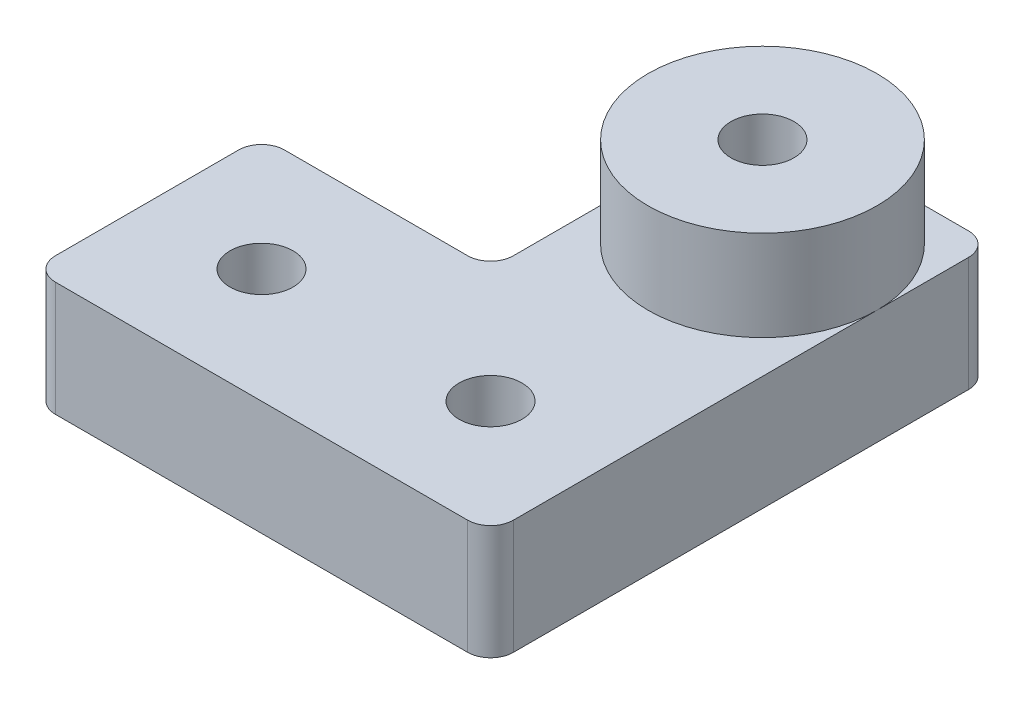
ISO-10303-21;
HEADER;
FILE_DESCRIPTION(('STEP AP214'),'2;1');
FILE_NAME('part.step','',(''),(''),'','','');
FILE_SCHEMA(('AUTOMOTIVE_DESIGN { 1 0 10303 214 1 1 1 1 }'));
ENDSEC;
DATA;
#1=APPLICATION_CONTEXT('core data for automotive mechanical design processes');
#2=APPLICATION_PROTOCOL_DEFINITION('international standard','automotive_design',2000,#1);
#3=PRODUCT_CONTEXT('',#1,'mechanical');
#4=PRODUCT('Part','Part','',(#3));
#5=PRODUCT_RELATED_PRODUCT_CATEGORY('part','',(#4));
#6=PRODUCT_DEFINITION_FORMATION('','',#4);
#7=PRODUCT_DEFINITION_CONTEXT('part definition',#1,'design');
#8=PRODUCT_DEFINITION('design','',#6,#7);
#9=PRODUCT_DEFINITION_SHAPE('','',#8);
#10=(LENGTH_UNIT() NAMED_UNIT(*) SI_UNIT(.MILLI.,.METRE.));
#11=(NAMED_UNIT(*) PLANE_ANGLE_UNIT() SI_UNIT($,.RADIAN.));
#12=(NAMED_UNIT(*) SI_UNIT($,.STERADIAN.) SOLID_ANGLE_UNIT());
#13=UNCERTAINTY_MEASURE_WITH_UNIT(LENGTH_MEASURE(1.E-05),#10,'distance_accuracy_value','');
#14=(GEOMETRIC_REPRESENTATION_CONTEXT(3) GLOBAL_UNCERTAINTY_ASSIGNED_CONTEXT((#13)) GLOBAL_UNIT_ASSIGNED_CONTEXT((#10,
#11,#12)) REPRESENTATION_CONTEXT('',''));
#15=CARTESIAN_POINT('',(0.,0.,0.));
#16=DIRECTION('',(0.,0.,1.));
#17=DIRECTION('',(1.,0.,0.));
#18=AXIS2_PLACEMENT_3D('',#15,#16,#17);
#19=CARTESIAN_POINT('',(0.,10.,0.));
#20=DIRECTION('',(0.,1.,0.));
#21=DIRECTION('',(0.,0.,1.));
#22=AXIS2_PLACEMENT_3D('',#19,#20,#21);
#23=PLANE('',#22);
#24=CARTESIAN_POINT('',(30.,10.,-33.75));
#25=DIRECTION('',(0.,1.,0.));
#26=DIRECTION('',(0.,0.,1.));
#27=AXIS2_PLACEMENT_3D('',#24,#25,#26);
#28=CIRCLE('',#27,10.);
#29=CARTESIAN_POINT('',(40.,10.,-33.75));
#30=VERTEX_POINT('',#29);
#31=CARTESIAN_POINT('',(30.,10.,-43.75));
#32=VERTEX_POINT('',#31);
#33=EDGE_CURVE('E54',#30,#32,#28,.T.);
#34=ORIENTED_EDGE('',*,*,#33,.F.);
#35=DIRECTION('',(0.,0.,-1.));
#36=VECTOR('',#35,1.);
#37=CARTESIAN_POINT('',(40.,10.,0.));
#38=LINE('',#37,#36);
#39=CARTESIAN_POINT('',(40.,10.,-41.75));
#40=VERTEX_POINT('',#39);
#41=EDGE_CURVE('E187',#30,#40,#38,.T.);
#42=ORIENTED_EDGE('',*,*,#41,.T.);
#43=CARTESIAN_POINT('',(38.,10.,-41.75));
#44=DIRECTION('',(0.,1.,0.));
#45=DIRECTION('',(0.,0.,1.));
#46=AXIS2_PLACEMENT_3D('',#43,#44,#45);
#47=CIRCLE('',#46,2.);
#48=CARTESIAN_POINT('',(38.,10.,-43.75));
#49=VERTEX_POINT('',#48);
#50=EDGE_CURVE('E349',#40,#49,#47,.T.);
#51=ORIENTED_EDGE('',*,*,#50,.T.);
#52=DIRECTION('',(-1.,0.,0.));
#53=VECTOR('',#52,1.);
#54=CARTESIAN_POINT('',(40.,10.,-43.75));
#55=LINE('',#54,#53);
#56=EDGE_CURVE('E201',#49,#32,#55,.T.);
#57=ORIENTED_EDGE('',*,*,#56,.T.);
#58=EDGE_LOOP('',(#34,#42,#51,#57));
#59=FACE_BOUND('',#58,.T.);
#60=ADVANCED_FACE('F43',(#59),#23,.T.);
#61=CARTESIAN_POINT('',(20.,10.,-33.75));
#62=VERTEX_POINT('',#61);
#63=EDGE_CURVE('E11',#32,#62,#28,.T.);
#64=ORIENTED_EDGE('',*,*,#63,.F.);
#65=CARTESIAN_POINT('',(22.,10.,-43.75));
#66=VERTEX_POINT('',#65);
#67=EDGE_CURVE('E186',#32,#66,#55,.T.);
#68=ORIENTED_EDGE('',*,*,#67,.T.);
#69=CARTESIAN_POINT('',(22.,10.,-41.75));
#70=DIRECTION('',(0.,1.,0.));
#71=DIRECTION('',(0.,0.,1.));
#72=AXIS2_PLACEMENT_3D('',#69,#70,#71);
#73=CIRCLE('',#72,2.);
#74=CARTESIAN_POINT('',(20.,10.,-41.75));
#75=VERTEX_POINT('',#74);
#76=EDGE_CURVE('E351',#66,#75,#73,.T.);
#77=ORIENTED_EDGE('',*,*,#76,.T.);
#78=DIRECTION('',(0.,0.,1.));
#79=VECTOR('',#78,1.);
#80=CARTESIAN_POINT('',(20.,10.,-43.75));
#81=LINE('',#80,#79);
#82=EDGE_CURVE('E297',#75,#62,#81,.T.);
#83=ORIENTED_EDGE('',*,*,#82,.T.);
#84=EDGE_LOOP('',(#64,#68,#77,#83));
#85=FACE_BOUND('',#84,.T.);
#86=ADVANCED_FACE('F411',(#85),#23,.T.);
#87=EDGE_CURVE('E52',#62,#30,#28,.T.);
#88=ORIENTED_EDGE('',*,*,#87,.F.);
#89=CARTESIAN_POINT('',(20.,10.,-22.));
#90=VERTEX_POINT('',#89);
#91=EDGE_CURVE('E296',#62,#90,#81,.T.);
#92=ORIENTED_EDGE('',*,*,#91,.T.);
#93=CARTESIAN_POINT('',(18.,10.,-22.));
#94=DIRECTION('',(0.,1.,0.));
#95=DIRECTION('',(0.,0.,1.));
#96=AXIS2_PLACEMENT_3D('',#93,#94,#95);
#97=CIRCLE('',#96,2.);
#98=CARTESIAN_POINT('',(18.,10.,-20.));
#99=VERTEX_POINT('',#98);
#100=EDGE_CURVE('E206',#90,#99,#97,.F.);
#101=ORIENTED_EDGE('',*,*,#100,.T.);
#102=DIRECTION('',(-1.,0.,0.));
#103=VECTOR('',#102,1.);
#104=CARTESIAN_POINT('',(20.,10.,-20.));
#105=LINE('',#104,#103);
#106=CARTESIAN_POINT('',(2.,10.,-20.));
#107=VERTEX_POINT('',#106);
#108=EDGE_CURVE('E299',#99,#107,#105,.T.);
#109=ORIENTED_EDGE('',*,*,#108,.T.);
#110=CARTESIAN_POINT('',(2.,10.,-18.));
#111=DIRECTION('',(0.,1.,0.));
#112=DIRECTION('',(0.,0.,1.));
#113=AXIS2_PLACEMENT_3D('',#110,#111,#112);
#114=CIRCLE('',#113,2.);
#115=CARTESIAN_POINT('',(0.,10.,-18.));
#116=VERTEX_POINT('',#115);
#117=EDGE_CURVE('E347',#107,#116,#114,.T.);
#118=ORIENTED_EDGE('',*,*,#117,.T.);
#119=DIRECTION('',(0.,0.,1.));
#120=VECTOR('',#119,1.);
#121=CARTESIAN_POINT('',(0.,10.,-20.));
#122=LINE('',#121,#120);
#123=CARTESIAN_POINT('',(0.,10.,-2.));
#124=VERTEX_POINT('',#123);
#125=EDGE_CURVE('E290',#116,#124,#122,.T.);
#126=ORIENTED_EDGE('',*,*,#125,.T.);
#127=CARTESIAN_POINT('',(2.,10.,-2.));
#128=DIRECTION('',(0.,1.,0.));
#129=DIRECTION('',(0.,0.,1.));
#130=AXIS2_PLACEMENT_3D('',#127,#128,#129);
#131=CIRCLE('',#130,2.);
#132=CARTESIAN_POINT('',(2.,10.,0.));
#133=VERTEX_POINT('',#132);
#134=EDGE_CURVE('E345',#124,#133,#131,.T.);
#135=ORIENTED_EDGE('',*,*,#134,.T.);
#136=DIRECTION('',(1.,0.,0.));
#137=VECTOR('',#136,1.);
#138=CARTESIAN_POINT('',(0.,10.,0.));
#139=LINE('',#138,#137);
#140=CARTESIAN_POINT('',(38.,10.,0.));
#141=VERTEX_POINT('',#140);
#142=EDGE_CURVE('E197',#133,#141,#139,.T.);
#143=ORIENTED_EDGE('',*,*,#142,.T.);
#144=CARTESIAN_POINT('',(38.,10.,-2.));
#145=DIRECTION('',(0.,1.,0.));
#146=DIRECTION('',(0.,0.,1.));
#147=AXIS2_PLACEMENT_3D('',#144,#145,#146);
#148=CIRCLE('',#147,2.);
#149=CARTESIAN_POINT('',(40.,10.,-2.));
#150=VERTEX_POINT('',#149);
#151=EDGE_CURVE('E182',#141,#150,#148,.T.);
#152=ORIENTED_EDGE('',*,*,#151,.T.);
#153=EDGE_CURVE('E176',#150,#30,#38,.T.);
#154=ORIENTED_EDGE('',*,*,#153,.T.);
#155=EDGE_LOOP('',(#88,#92,#101,#109,#118,#126,#135,#143,#152,#154));
#156=FACE_BOUND('',#155,.T.);
#157=CARTESIAN_POINT('',(30.,10.,-10.));
#158=DIRECTION('',(0.,-1.,0.));
#159=DIRECTION('',(0.,0.,-1.));
#160=AXIS2_PLACEMENT_3D('',#157,#158,#159);
#161=CIRCLE('',#160,2.75);
#162=CARTESIAN_POINT('',(30.,10.,-12.75));
#163=VERTEX_POINT('',#162);
#164=EDGE_CURVE('E286',#163,#163,#161,.T.);
#165=ORIENTED_EDGE('',*,*,#164,.T.);
#166=EDGE_LOOP('',(#165));
#167=FACE_BOUND('',#166,.T.);
#168=CARTESIAN_POINT('',(10.,10.,-10.));
#169=DIRECTION('',(0.,-1.,0.));
#170=DIRECTION('',(0.,0.,-1.));
#171=AXIS2_PLACEMENT_3D('',#168,#169,#170);
#172=CIRCLE('',#171,2.75);
#173=CARTESIAN_POINT('',(10.,10.,-12.75));
#174=VERTEX_POINT('',#173);
#175=EDGE_CURVE('E271',#174,#174,#172,.T.);
#176=ORIENTED_EDGE('',*,*,#175,.T.);
#177=EDGE_LOOP('',(#176));
#178=FACE_BOUND('',#177,.T.);
#179=ADVANCED_FACE('F178',(#156,#167,#178),#23,.T.);
#180=CARTESIAN_POINT('',(0.,10.,-20.));
#181=DIRECTION('',(1.,0.,0.));
#182=DIRECTION('',(0.,0.,-1.));
#183=AXIS2_PLACEMENT_3D('',#180,#181,#182);
#184=PLANE('',#183);
#185=ORIENTED_EDGE('',*,*,#125,.F.);
#186=DIRECTION('',(0.,-1.,0.));
#187=VECTOR('',#186,1.);
#188=CARTESIAN_POINT('',(0.,10.,-18.));
#189=LINE('',#188,#187);
#190=CARTESIAN_POINT('',(0.,0.,-18.));
#191=VERTEX_POINT('',#190);
#192=EDGE_CURVE('E358',#116,#191,#189,.T.);
#193=ORIENTED_EDGE('',*,*,#192,.T.);
#194=DIRECTION('',(0.,0.,1.));
#195=VECTOR('',#194,1.);
#196=CARTESIAN_POINT('',(0.,0.,-20.));
#197=LINE('',#196,#195);
#198=CARTESIAN_POINT('',(0.,0.,-2.));
#199=VERTEX_POINT('',#198);
#200=EDGE_CURVE('E289',#191,#199,#197,.T.);
#201=ORIENTED_EDGE('',*,*,#200,.T.);
#202=DIRECTION('',(0.,-1.,0.));
#203=VECTOR('',#202,1.);
#204=CARTESIAN_POINT('',(0.,10.,-2.));
#205=LINE('',#204,#203);
#206=EDGE_CURVE('E356',#199,#124,#205,.F.);
#207=ORIENTED_EDGE('',*,*,#206,.T.);
#208=EDGE_LOOP('',(#185,#193,#201,#207));
#209=FACE_BOUND('',#208,.T.);
#210=ADVANCED_FACE('F390',(#209),#184,.F.);
#211=CARTESIAN_POINT('',(0.,10.,0.));
#212=DIRECTION('',(0.,0.,-1.));
#213=DIRECTION('',(-1.,0.,0.));
#214=AXIS2_PLACEMENT_3D('',#211,#212,#213);
#215=PLANE('',#214);
#216=ORIENTED_EDGE('',*,*,#142,.F.);
#217=DIRECTION('',(0.,-1.,0.));
#218=VECTOR('',#217,1.);
#219=CARTESIAN_POINT('',(2.,10.,0.));
#220=LINE('',#219,#218);
#221=CARTESIAN_POINT('',(2.,0.,0.));
#222=VERTEX_POINT('',#221);
#223=EDGE_CURVE('E363',#133,#222,#220,.T.);
#224=ORIENTED_EDGE('',*,*,#223,.T.);
#225=DIRECTION('',(1.,0.,0.));
#226=VECTOR('',#225,1.);
#227=CARTESIAN_POINT('',(0.,0.,0.));
#228=LINE('',#227,#226);
#229=CARTESIAN_POINT('',(38.,0.,0.));
#230=VERTEX_POINT('',#229);
#231=EDGE_CURVE('E305',#222,#230,#228,.T.);
#232=ORIENTED_EDGE('',*,*,#231,.T.);
#233=DIRECTION('',(0.,-1.,0.));
#234=VECTOR('',#233,1.);
#235=CARTESIAN_POINT('',(38.,10.,0.));
#236=LINE('',#235,#234);
#237=EDGE_CURVE('E361',#230,#141,#236,.F.);
#238=ORIENTED_EDGE('',*,*,#237,.T.);
#239=EDGE_LOOP('',(#216,#224,#232,#238));
#240=FACE_BOUND('',#239,.T.);
#241=ADVANCED_FACE('F398',(#240),#215,.F.);
#242=CARTESIAN_POINT('',(40.,10.,0.));
#243=DIRECTION('',(-1.,0.,0.));
#244=DIRECTION('',(0.,0.,1.));
#245=AXIS2_PLACEMENT_3D('',#242,#243,#244);
#246=PLANE('',#245);
#247=DIRECTION('',(0.,0.,-1.));
#248=VECTOR('',#247,1.);
#249=CARTESIAN_POINT('',(40.,0.,0.));
#250=LINE('',#249,#248);
#251=CARTESIAN_POINT('',(40.,0.,-2.));
#252=VERTEX_POINT('',#251);
#253=CARTESIAN_POINT('',(40.,0.,-41.75));
#254=VERTEX_POINT('',#253);
#255=EDGE_CURVE('E308',#252,#254,#250,.T.);
#256=ORIENTED_EDGE('',*,*,#255,.T.);
#257=DIRECTION('',(0.,-1.,0.));
#258=VECTOR('',#257,1.);
#259=CARTESIAN_POINT('',(40.,10.,-41.75));
#260=LINE('',#259,#258);
#261=EDGE_CURVE('E194',#254,#40,#260,.F.);
#262=ORIENTED_EDGE('',*,*,#261,.T.);
#263=ORIENTED_EDGE('',*,*,#41,.F.);
#264=ORIENTED_EDGE('',*,*,#153,.F.);
#265=DIRECTION('',(0.,-1.,0.));
#266=VECTOR('',#265,1.);
#267=CARTESIAN_POINT('',(40.,10.,-2.));
#268=LINE('',#267,#266);
#269=EDGE_CURVE('E353',#150,#252,#268,.T.);
#270=ORIENTED_EDGE('',*,*,#269,.T.);
#271=EDGE_LOOP('',(#256,#262,#263,#264,#270));
#272=FACE_BOUND('',#271,.T.);
#273=ADVANCED_FACE('F192',(#272),#246,.F.);
#274=CARTESIAN_POINT('',(40.,10.,-43.75));
#275=DIRECTION('',(0.,0.,1.));
#276=DIRECTION('',(1.,0.,0.));
#277=AXIS2_PLACEMENT_3D('',#274,#275,#276);
#278=PLANE('',#277);
#279=DIRECTION('',(-1.,0.,0.));
#280=VECTOR('',#279,1.);
#281=CARTESIAN_POINT('',(40.,0.,-43.75));
#282=LINE('',#281,#280);
#283=CARTESIAN_POINT('',(38.,0.,-43.75));
#284=VERTEX_POINT('',#283);
#285=CARTESIAN_POINT('',(22.,0.,-43.75));
#286=VERTEX_POINT('',#285);
#287=EDGE_CURVE('E310',#284,#286,#282,.T.);
#288=ORIENTED_EDGE('',*,*,#287,.T.);
#289=DIRECTION('',(0.,-1.,0.));
#290=VECTOR('',#289,1.);
#291=CARTESIAN_POINT('',(22.,10.,-43.75));
#292=LINE('',#291,#290);
#293=EDGE_CURVE('E341',#286,#66,#292,.F.);
#294=ORIENTED_EDGE('',*,*,#293,.T.);
#295=ORIENTED_EDGE('',*,*,#67,.F.);
#296=ORIENTED_EDGE('',*,*,#56,.F.);
#297=DIRECTION('',(0.,-1.,0.));
#298=VECTOR('',#297,1.);
#299=CARTESIAN_POINT('',(38.,10.,-43.75));
#300=LINE('',#299,#298);
#301=EDGE_CURVE('E338',#49,#284,#300,.T.);
#302=ORIENTED_EDGE('',*,*,#301,.T.);
#303=EDGE_LOOP('',(#288,#294,#295,#296,#302));
#304=FACE_BOUND('',#303,.T.);
#305=ADVANCED_FACE('F408',(#304),#278,.F.);
#306=CARTESIAN_POINT('',(20.,10.,-43.75));
#307=DIRECTION('',(1.,0.,0.));
#308=DIRECTION('',(0.,0.,-1.));
#309=AXIS2_PLACEMENT_3D('',#306,#307,#308);
#310=PLANE('',#309);
#311=DIRECTION('',(0.,0.,1.));
#312=VECTOR('',#311,1.);
#313=CARTESIAN_POINT('',(20.,0.,-43.75));
#314=LINE('',#313,#312);
#315=CARTESIAN_POINT('',(20.,0.,-41.75));
#316=VERTEX_POINT('',#315);
#317=CARTESIAN_POINT('',(20.,0.,-22.));
#318=VERTEX_POINT('',#317);
#319=EDGE_CURVE('E313',#316,#318,#314,.T.);
#320=ORIENTED_EDGE('',*,*,#319,.T.);
#321=DIRECTION('',(0.,-1.,0.));
#322=VECTOR('',#321,1.);
#323=CARTESIAN_POINT('',(20.,10.,-22.));
#324=LINE('',#323,#322);
#325=EDGE_CURVE('E325',#318,#90,#324,.F.);
#326=ORIENTED_EDGE('',*,*,#325,.T.);
#327=ORIENTED_EDGE('',*,*,#91,.F.);
#328=ORIENTED_EDGE('',*,*,#82,.F.);
#329=DIRECTION('',(0.,-1.,0.));
#330=VECTOR('',#329,1.);
#331=CARTESIAN_POINT('',(20.,10.,-41.75));
#332=LINE('',#331,#330);
#333=EDGE_CURVE('E322',#75,#316,#332,.T.);
#334=ORIENTED_EDGE('',*,*,#333,.T.);
#335=EDGE_LOOP('',(#320,#326,#327,#328,#334));
#336=FACE_BOUND('',#335,.T.);
#337=ADVANCED_FACE('F374',(#336),#310,.F.);
#338=CARTESIAN_POINT('',(20.,10.,-20.));
#339=DIRECTION('',(0.,0.,1.));
#340=DIRECTION('',(1.,0.,0.));
#341=AXIS2_PLACEMENT_3D('',#338,#339,#340);
#342=PLANE('',#341);
#343=ORIENTED_EDGE('',*,*,#108,.F.);
#344=DIRECTION('',(0.,-1.,0.));
#345=VECTOR('',#344,1.);
#346=CARTESIAN_POINT('',(18.,0.,-20.));
#347=LINE('',#346,#345);
#348=CARTESIAN_POINT('',(18.,0.,-20.));
#349=VERTEX_POINT('',#348);
#350=EDGE_CURVE('E319',#99,#349,#347,.T.);
#351=ORIENTED_EDGE('',*,*,#350,.T.);
#352=DIRECTION('',(-1.,0.,0.));
#353=VECTOR('',#352,1.);
#354=CARTESIAN_POINT('',(20.,0.,-20.));
#355=LINE('',#354,#353);
#356=CARTESIAN_POINT('',(2.,0.,-20.));
#357=VERTEX_POINT('',#356);
#358=EDGE_CURVE('E293',#349,#357,#355,.T.);
#359=ORIENTED_EDGE('',*,*,#358,.T.);
#360=DIRECTION('',(0.,-1.,0.));
#361=VECTOR('',#360,1.);
#362=CARTESIAN_POINT('',(2.,10.,-20.));
#363=LINE('',#362,#361);
#364=EDGE_CURVE('E302',#357,#107,#363,.F.);
#365=ORIENTED_EDGE('',*,*,#364,.T.);
#366=EDGE_LOOP('',(#343,#351,#359,#365));
#367=FACE_BOUND('',#366,.T.);
#368=ADVANCED_FACE('F382',(#367),#342,.F.);
#369=CARTESIAN_POINT('',(0.,0.,0.));
#370=DIRECTION('',(0.,1.,0.));
#371=DIRECTION('',(0.,0.,1.));
#372=AXIS2_PLACEMENT_3D('',#369,#370,#371);
#373=PLANE('',#372);
#374=DIRECTION('',(-0.499999999999999,0.,0.866025403784439));
#375=VECTOR('',#374,1.);
#376=CARTESIAN_POINT('',(34.7,0.,-33.75));
#377=LINE('',#376,#375);
#378=CARTESIAN_POINT('',(34.7,0.,-33.75));
#379=VERTEX_POINT('',#378);
#380=CARTESIAN_POINT('',(32.35,0.,-29.6796806022132));
#381=VERTEX_POINT('',#380);
#382=EDGE_CURVE('E233',#379,#381,#377,.T.);
#383=ORIENTED_EDGE('',*,*,#382,.F.);
#384=DIRECTION('',(0.5,0.,0.866025403784439));
#385=VECTOR('',#384,1.);
#386=CARTESIAN_POINT('',(32.35,0.,-37.8203193977869));
#387=LINE('',#386,#385);
#388=CARTESIAN_POINT('',(32.35,0.,-37.8203193977869));
#389=VERTEX_POINT('',#388);
#390=EDGE_CURVE('E231',#389,#379,#387,.T.);
#391=ORIENTED_EDGE('',*,*,#390,.F.);
#392=DIRECTION('',(1.,0.,0.));
#393=VECTOR('',#392,1.);
#394=CARTESIAN_POINT('',(27.65,0.,-37.8203193977869));
#395=LINE('',#394,#393);
#396=CARTESIAN_POINT('',(27.65,0.,-37.8203193977869));
#397=VERTEX_POINT('',#396);
#398=EDGE_CURVE('E215',#397,#389,#395,.T.);
#399=ORIENTED_EDGE('',*,*,#398,.F.);
#400=DIRECTION('',(0.5,0.,-0.866025403784439));
#401=VECTOR('',#400,1.);
#402=CARTESIAN_POINT('',(25.3,0.,-33.75));
#403=LINE('',#402,#401);
#404=CARTESIAN_POINT('',(25.3,0.,-33.75));
#405=VERTEX_POINT('',#404);
#406=EDGE_CURVE('E242',#405,#397,#403,.T.);
#407=ORIENTED_EDGE('',*,*,#406,.F.);
#408=DIRECTION('',(-0.5,0.,-0.866025403784439));
#409=VECTOR('',#408,1.);
#410=CARTESIAN_POINT('',(27.65,0.,-29.6796806022132));
#411=LINE('',#410,#409);
#412=CARTESIAN_POINT('',(27.65,0.,-29.6796806022132));
#413=VERTEX_POINT('',#412);
#414=EDGE_CURVE('E239',#413,#405,#411,.T.);
#415=ORIENTED_EDGE('',*,*,#414,.F.);
#416=DIRECTION('',(-1.,0.,0.));
#417=VECTOR('',#416,1.);
#418=CARTESIAN_POINT('',(32.35,0.,-29.6796806022132));
#419=LINE('',#418,#417);
#420=EDGE_CURVE('E236',#381,#413,#419,.T.);
#421=ORIENTED_EDGE('',*,*,#420,.F.);
#422=EDGE_LOOP('',(#383,#391,#399,#407,#415,#421));
#423=FACE_BOUND('',#422,.T.);
#424=CARTESIAN_POINT('',(10.,0.,-10.));
#425=DIRECTION('',(0.,-1.,0.));
#426=DIRECTION('',(0.,0.,-1.));
#427=AXIS2_PLACEMENT_3D('',#424,#425,#426);
#428=CIRCLE('',#427,5.025);
#429=CARTESIAN_POINT('',(10.,0.,-15.025));
#430=VERTEX_POINT('',#429);
#431=EDGE_CURVE('E249',#430,#430,#428,.T.);
#432=ORIENTED_EDGE('',*,*,#431,.F.);
#433=EDGE_LOOP('',(#432));
#434=FACE_BOUND('',#433,.T.);
#435=CARTESIAN_POINT('',(30.,0.,-10.));
#436=DIRECTION('',(0.,-1.,0.));
#437=DIRECTION('',(0.,0.,-1.));
#438=AXIS2_PLACEMENT_3D('',#435,#436,#437);
#439=CIRCLE('',#438,5.025);
#440=CARTESIAN_POINT('',(30.,0.,-15.025));
#441=VERTEX_POINT('',#440);
#442=EDGE_CURVE('E274',#441,#441,#439,.T.);
#443=ORIENTED_EDGE('',*,*,#442,.F.);
#444=EDGE_LOOP('',(#443));
#445=FACE_BOUND('',#444,.T.);
#446=ORIENTED_EDGE('',*,*,#319,.F.);
#447=CARTESIAN_POINT('',(22.,0.,-41.75));
#448=DIRECTION('',(0.,1.,0.));
#449=DIRECTION('',(0.,0.,1.));
#450=AXIS2_PLACEMENT_3D('',#447,#448,#449);
#451=CIRCLE('',#450,2.);
#452=EDGE_CURVE('E336',#316,#286,#451,.F.);
#453=ORIENTED_EDGE('',*,*,#452,.T.);
#454=ORIENTED_EDGE('',*,*,#287,.F.);
#455=CARTESIAN_POINT('',(38.,0.,-41.75));
#456=DIRECTION('',(0.,1.,0.));
#457=DIRECTION('',(0.,0.,1.));
#458=AXIS2_PLACEMENT_3D('',#455,#456,#457);
#459=CIRCLE('',#458,2.);
#460=EDGE_CURVE('E334',#284,#254,#459,.F.);
#461=ORIENTED_EDGE('',*,*,#460,.T.);
#462=ORIENTED_EDGE('',*,*,#255,.F.);
#463=CARTESIAN_POINT('',(38.,0.,-2.));
#464=DIRECTION('',(0.,1.,0.));
#465=DIRECTION('',(0.,0.,1.));
#466=AXIS2_PLACEMENT_3D('',#463,#464,#465);
#467=CIRCLE('',#466,2.);
#468=EDGE_CURVE('E328',#252,#230,#467,.F.);
#469=ORIENTED_EDGE('',*,*,#468,.T.);
#470=ORIENTED_EDGE('',*,*,#231,.F.);
#471=CARTESIAN_POINT('',(2.,0.,-2.));
#472=DIRECTION('',(0.,1.,0.));
#473=DIRECTION('',(0.,0.,1.));
#474=AXIS2_PLACEMENT_3D('',#471,#472,#473);
#475=CIRCLE('',#474,2.);
#476=EDGE_CURVE('E330',#222,#199,#475,.F.);
#477=ORIENTED_EDGE('',*,*,#476,.T.);
#478=ORIENTED_EDGE('',*,*,#200,.F.);
#479=CARTESIAN_POINT('',(2.,0.,-18.));
#480=DIRECTION('',(0.,1.,0.));
#481=DIRECTION('',(0.,0.,1.));
#482=AXIS2_PLACEMENT_3D('',#479,#480,#481);
#483=CIRCLE('',#482,2.);
#484=EDGE_CURVE('E332',#191,#357,#483,.F.);
#485=ORIENTED_EDGE('',*,*,#484,.T.);
#486=ORIENTED_EDGE('',*,*,#358,.F.);
#487=CARTESIAN_POINT('',(18.,0.,-22.));
#488=DIRECTION('',(0.,1.,0.));
#489=DIRECTION('',(0.,0.,1.));
#490=AXIS2_PLACEMENT_3D('',#487,#488,#489);
#491=CIRCLE('',#490,2.);
#492=EDGE_CURVE('E207',#349,#318,#491,.T.);
#493=ORIENTED_EDGE('',*,*,#492,.T.);
#494=EDGE_LOOP('',(#446,#453,#454,#461,#462,#469,#470,#477,#478,#485,#486,#493));
#495=FACE_BOUND('',#494,.T.);
#496=ADVANCED_FACE('F369',(#423,#434,#445,#495),#373,.F.);
#497=CARTESIAN_POINT('',(30.,0.,-10.));
#498=DIRECTION('',(0.,-1.,0.));
#499=DIRECTION('',(0.,0.,-1.));
#500=AXIS2_PLACEMENT_3D('',#497,#498,#499);
#501=CYLINDRICAL_SURFACE('',#500,2.75);
#502=ORIENTED_EDGE('',*,*,#164,.F.);
#503=EDGE_LOOP('',(#502));
#504=FACE_BOUND('',#503,.T.);
#505=CARTESIAN_POINT('',(30.,4.99999999999999,-10.));
#506=DIRECTION('',(0.,-1.,0.));
#507=DIRECTION('',(0.,0.,-1.));
#508=AXIS2_PLACEMENT_3D('',#505,#506,#507);
#509=CIRCLE('',#508,2.75000000000001);
#510=CARTESIAN_POINT('',(30.,4.99999999999999,-12.75));
#511=VERTEX_POINT('',#510);
#512=EDGE_CURVE('E283',#511,#511,#509,.T.);
#513=ORIENTED_EDGE('',*,*,#512,.T.);
#514=EDGE_LOOP('',(#513));
#515=FACE_BOUND('',#514,.T.);
#516=ADVANCED_FACE('F449',(#504,#515),#501,.F.);
#517=CARTESIAN_POINT('',(35.,4.99999999999999,-10.));
#518=DIRECTION('',(0.,1.,0.));
#519=DIRECTION('',(0.,0.,1.));
#520=AXIS2_PLACEMENT_3D('',#517,#518,#519);
#521=PLANE('',#520);
#522=ORIENTED_EDGE('',*,*,#512,.F.);
#523=EDGE_LOOP('',(#522));
#524=FACE_BOUND('',#523,.T.);
#525=CARTESIAN_POINT('',(30.,4.99999999999999,-10.));
#526=DIRECTION('',(0.,-1.,0.));
#527=DIRECTION('',(0.,0.,-1.));
#528=AXIS2_PLACEMENT_3D('',#525,#526,#527);
#529=CIRCLE('',#528,4.99999999999999);
#530=CARTESIAN_POINT('',(30.,4.99999999999999,-15.));
#531=VERTEX_POINT('',#530);
#532=EDGE_CURVE('E280',#531,#531,#529,.T.);
#533=ORIENTED_EDGE('',*,*,#532,.T.);
#534=EDGE_LOOP('',(#533));
#535=FACE_BOUND('',#534,.T.);
#536=ADVANCED_FACE('F456',(#524,#535),#521,.F.);
#537=CARTESIAN_POINT('',(30.,0.,-10.));
#538=DIRECTION('',(0.,-1.,0.));
#539=DIRECTION('',(0.,0.,-1.));
#540=AXIS2_PLACEMENT_3D('',#537,#538,#539);
#541=CYLINDRICAL_SURFACE('',#540,4.99999999999999);
#542=ORIENTED_EDGE('',*,*,#532,.F.);
#543=EDGE_LOOP('',(#542));
#544=FACE_BOUND('',#543,.T.);
#545=CARTESIAN_POINT('',(30.,0.0250000000000068,-10.));
#546=DIRECTION('',(0.,-1.,0.));
#547=DIRECTION('',(0.,0.,-1.));
#548=AXIS2_PLACEMENT_3D('',#545,#546,#547);
#549=CIRCLE('',#548,4.99999999999999);
#550=CARTESIAN_POINT('',(30.,0.0250000000000068,-15.));
#551=VERTEX_POINT('',#550);
#552=EDGE_CURVE('E277',#551,#551,#549,.T.);
#553=ORIENTED_EDGE('',*,*,#552,.T.);
#554=EDGE_LOOP('',(#553));
#555=FACE_BOUND('',#554,.T.);
#556=ADVANCED_FACE('F469',(#544,#555),#541,.F.);
#557=CARTESIAN_POINT('',(30.,0.,-10.));
#558=DIRECTION('',(0.,-1.,0.));
#559=DIRECTION('',(0.,0.,-1.));
#560=AXIS2_PLACEMENT_3D('',#557,#558,#559);
#561=CONICAL_SURFACE('',#560,5.025,0.785398163397483);
#562=ORIENTED_EDGE('',*,*,#552,.F.);
#563=EDGE_LOOP('',(#562));
#564=FACE_BOUND('',#563,.T.);
#565=ORIENTED_EDGE('',*,*,#442,.T.);
#566=EDGE_LOOP('',(#565));
#567=FACE_BOUND('',#566,.T.);
#568=ADVANCED_FACE('F466',(#564,#567),#561,.F.);
#569=CARTESIAN_POINT('',(10.,0.,-10.));
#570=DIRECTION('',(0.,-1.,0.));
#571=DIRECTION('',(0.,0.,-1.));
#572=AXIS2_PLACEMENT_3D('',#569,#570,#571);
#573=CYLINDRICAL_SURFACE('',#572,2.75);
#574=ORIENTED_EDGE('',*,*,#175,.F.);
#575=EDGE_LOOP('',(#574));
#576=FACE_BOUND('',#575,.T.);
#577=CARTESIAN_POINT('',(10.,4.99999999999999,-10.));
#578=DIRECTION('',(0.,-1.,0.));
#579=DIRECTION('',(0.,0.,-1.));
#580=AXIS2_PLACEMENT_3D('',#577,#578,#579);
#581=CIRCLE('',#580,2.75000000000001);
#582=CARTESIAN_POINT('',(10.,4.99999999999999,-12.75));
#583=VERTEX_POINT('',#582);
#584=EDGE_CURVE('E268',#583,#583,#581,.T.);
#585=ORIENTED_EDGE('',*,*,#584,.T.);
#586=EDGE_LOOP('',(#585));
#587=FACE_BOUND('',#586,.T.);
#588=ADVANCED_FACE('F468',(#576,#587),#573,.F.);
#589=CARTESIAN_POINT('',(15.,4.99999999999999,-10.));
#590=DIRECTION('',(0.,1.,0.));
#591=DIRECTION('',(0.,0.,1.));
#592=AXIS2_PLACEMENT_3D('',#589,#590,#591);
#593=PLANE('',#592);
#594=ORIENTED_EDGE('',*,*,#584,.F.);
#595=EDGE_LOOP('',(#594));
#596=FACE_BOUND('',#595,.T.);
#597=CARTESIAN_POINT('',(10.,4.99999999999999,-10.));
#598=DIRECTION('',(0.,-1.,0.));
#599=DIRECTION('',(0.,0.,-1.));
#600=AXIS2_PLACEMENT_3D('',#597,#598,#599);
#601=CIRCLE('',#600,4.99999999999999);
#602=CARTESIAN_POINT('',(10.,4.99999999999999,-15.));
#603=VERTEX_POINT('',#602);
#604=EDGE_CURVE('E265',#603,#603,#601,.T.);
#605=ORIENTED_EDGE('',*,*,#604,.T.);
#606=EDGE_LOOP('',(#605));
#607=FACE_BOUND('',#606,.T.);
#608=ADVANCED_FACE('F476',(#596,#607),#593,.F.);
#609=CARTESIAN_POINT('',(10.,0.,-10.));
#610=DIRECTION('',(0.,-1.,0.));
#611=DIRECTION('',(0.,0.,-1.));
#612=AXIS2_PLACEMENT_3D('',#609,#610,#611);
#613=CYLINDRICAL_SURFACE('',#612,4.99999999999999);
#614=ORIENTED_EDGE('',*,*,#604,.F.);
#615=EDGE_LOOP('',(#614));
#616=FACE_BOUND('',#615,.T.);
#617=CARTESIAN_POINT('',(10.,0.0250000000000068,-10.));
#618=DIRECTION('',(0.,-1.,0.));
#619=DIRECTION('',(0.,0.,-1.));
#620=AXIS2_PLACEMENT_3D('',#617,#618,#619);
#621=CIRCLE('',#620,4.99999999999999);
#622=CARTESIAN_POINT('',(10.,0.0250000000000068,-15.));
#623=VERTEX_POINT('',#622);
#624=EDGE_CURVE('E262',#623,#623,#621,.T.);
#625=ORIENTED_EDGE('',*,*,#624,.T.);
#626=EDGE_LOOP('',(#625));
#627=FACE_BOUND('',#626,.T.);
#628=ADVANCED_FACE('F521',(#616,#627),#613,.F.);
#629=CARTESIAN_POINT('',(10.,0.,-10.));
#630=DIRECTION('',(0.,-1.,0.));
#631=DIRECTION('',(0.,0.,-1.));
#632=AXIS2_PLACEMENT_3D('',#629,#630,#631);
#633=CONICAL_SURFACE('',#632,5.025,0.785398163397414);
#634=ORIENTED_EDGE('',*,*,#624,.F.);
#635=EDGE_LOOP('',(#634));
#636=FACE_BOUND('',#635,.T.);
#637=ORIENTED_EDGE('',*,*,#431,.T.);
#638=EDGE_LOOP('',(#637));
#639=FACE_BOUND('',#638,.T.);
#640=ADVANCED_FACE('F421',(#636,#639),#633,.F.);
#641=CARTESIAN_POINT('',(18.,10.,-22.));
#642=DIRECTION('',(0.,1.,0.));
#643=DIRECTION('',(0.,0.,1.));
#644=AXIS2_PLACEMENT_3D('',#641,#642,#643);
#645=CYLINDRICAL_SURFACE('',#644,2.);
#646=ORIENTED_EDGE('',*,*,#100,.F.);
#647=ORIENTED_EDGE('',*,*,#325,.F.);
#648=ORIENTED_EDGE('',*,*,#492,.F.);
#649=ORIENTED_EDGE('',*,*,#350,.F.);
#650=EDGE_LOOP('',(#646,#647,#648,#649));
#651=FACE_BOUND('',#650,.T.);
#652=ADVANCED_FACE('F378',(#651),#645,.F.);
#653=CARTESIAN_POINT('',(22.,10.,-41.75));
#654=DIRECTION('',(0.,-1.,0.));
#655=DIRECTION('',(0.,0.,-1.));
#656=AXIS2_PLACEMENT_3D('',#653,#654,#655);
#657=CYLINDRICAL_SURFACE('',#656,2.);
#658=ORIENTED_EDGE('',*,*,#76,.F.);
#659=ORIENTED_EDGE('',*,*,#293,.F.);
#660=ORIENTED_EDGE('',*,*,#452,.F.);
#661=ORIENTED_EDGE('',*,*,#333,.F.);
#662=EDGE_LOOP('',(#658,#659,#660,#661));
#663=FACE_BOUND('',#662,.T.);
#664=ADVANCED_FACE('F413',(#663),#657,.T.);
#665=CARTESIAN_POINT('',(38.,10.,-41.75));
#666=DIRECTION('',(0.,-1.,0.));
#667=DIRECTION('',(0.,0.,-1.));
#668=AXIS2_PLACEMENT_3D('',#665,#666,#667);
#669=CYLINDRICAL_SURFACE('',#668,2.);
#670=ORIENTED_EDGE('',*,*,#50,.F.);
#671=ORIENTED_EDGE('',*,*,#261,.F.);
#672=ORIENTED_EDGE('',*,*,#460,.F.);
#673=ORIENTED_EDGE('',*,*,#301,.F.);
#674=EDGE_LOOP('',(#670,#671,#672,#673));
#675=FACE_BOUND('',#674,.T.);
#676=ADVANCED_FACE('F406',(#675),#669,.T.);
#677=CARTESIAN_POINT('',(2.,10.,-18.));
#678=DIRECTION('',(0.,-1.,0.));
#679=DIRECTION('',(0.,0.,-1.));
#680=AXIS2_PLACEMENT_3D('',#677,#678,#679);
#681=CYLINDRICAL_SURFACE('',#680,2.);
#682=ORIENTED_EDGE('',*,*,#117,.F.);
#683=ORIENTED_EDGE('',*,*,#364,.F.);
#684=ORIENTED_EDGE('',*,*,#484,.F.);
#685=ORIENTED_EDGE('',*,*,#192,.F.);
#686=EDGE_LOOP('',(#682,#683,#684,#685));
#687=FACE_BOUND('',#686,.T.);
#688=ADVANCED_FACE('F385',(#687),#681,.T.);
#689=CARTESIAN_POINT('',(2.,10.,-2.));
#690=DIRECTION('',(0.,-1.,0.));
#691=DIRECTION('',(0.,0.,-1.));
#692=AXIS2_PLACEMENT_3D('',#689,#690,#691);
#693=CYLINDRICAL_SURFACE('',#692,2.);
#694=ORIENTED_EDGE('',*,*,#134,.F.);
#695=ORIENTED_EDGE('',*,*,#206,.F.);
#696=ORIENTED_EDGE('',*,*,#476,.F.);
#697=ORIENTED_EDGE('',*,*,#223,.F.);
#698=EDGE_LOOP('',(#694,#695,#696,#697));
#699=FACE_BOUND('',#698,.T.);
#700=ADVANCED_FACE('F394',(#699),#693,.T.);
#701=CARTESIAN_POINT('',(38.,10.,-2.));
#702=DIRECTION('',(0.,-1.,0.));
#703=DIRECTION('',(0.,0.,-1.));
#704=AXIS2_PLACEMENT_3D('',#701,#702,#703);
#705=CYLINDRICAL_SURFACE('',#704,2.);
#706=ORIENTED_EDGE('',*,*,#151,.F.);
#707=ORIENTED_EDGE('',*,*,#237,.F.);
#708=ORIENTED_EDGE('',*,*,#468,.F.);
#709=ORIENTED_EDGE('',*,*,#269,.F.);
#710=EDGE_LOOP('',(#706,#707,#708,#709));
#711=FACE_BOUND('',#710,.T.);
#712=ADVANCED_FACE('F45',(#711),#705,.T.);
#713=CARTESIAN_POINT('',(32.35,4.2,-37.8203193977869));
#714=DIRECTION('',(0.866025403784439,0.,-0.5));
#715=DIRECTION('',(-0.5,0.,-0.866025403784439));
#716=AXIS2_PLACEMENT_3D('',#713,#714,#715);
#717=PLANE('',#716);
#718=ORIENTED_EDGE('',*,*,#390,.T.);
#719=DIRECTION('',(0.,-1.,0.));
#720=VECTOR('',#719,1.);
#721=CARTESIAN_POINT('',(34.7,4.2,-33.75));
#722=LINE('',#721,#720);
#723=CARTESIAN_POINT('',(34.7,4.2,-33.75));
#724=VERTEX_POINT('',#723);
#725=EDGE_CURVE('E230',#724,#379,#722,.T.);
#726=ORIENTED_EDGE('',*,*,#725,.F.);
#727=DIRECTION('',(0.5,0.,0.866025403784439));
#728=VECTOR('',#727,1.);
#729=CARTESIAN_POINT('',(32.35,4.2,-37.8203193977869));
#730=LINE('',#729,#728);
#731=CARTESIAN_POINT('',(32.35,4.2,-37.8203193977869));
#732=VERTEX_POINT('',#731);
#733=EDGE_CURVE('E211',#732,#724,#730,.T.);
#734=ORIENTED_EDGE('',*,*,#733,.F.);
#735=DIRECTION('',(0.,-1.,0.));
#736=VECTOR('',#735,1.);
#737=CARTESIAN_POINT('',(32.35,4.2,-37.8203193977869));
#738=LINE('',#737,#736);
#739=EDGE_CURVE('E247',#732,#389,#738,.T.);
#740=ORIENTED_EDGE('',*,*,#739,.T.);
#741=EDGE_LOOP('',(#718,#726,#734,#740));
#742=FACE_BOUND('',#741,.T.);
#743=ADVANCED_FACE('F609',(#742),#717,.F.);
#744=CARTESIAN_POINT('',(27.65,4.2,-37.8203193977869));
#745=DIRECTION('',(0.,0.,-1.));
#746=DIRECTION('',(-1.,0.,0.));
#747=AXIS2_PLACEMENT_3D('',#744,#745,#746);
#748=PLANE('',#747);
#749=ORIENTED_EDGE('',*,*,#398,.T.);
#750=ORIENTED_EDGE('',*,*,#739,.F.);
#751=DIRECTION('',(1.,0.,0.));
#752=VECTOR('',#751,1.);
#753=CARTESIAN_POINT('',(27.65,4.2,-37.8203193977869));
#754=LINE('',#753,#752);
#755=CARTESIAN_POINT('',(27.65,4.2,-37.8203193977869));
#756=VERTEX_POINT('',#755);
#757=EDGE_CURVE('E227',#756,#732,#754,.T.);
#758=ORIENTED_EDGE('',*,*,#757,.F.);
#759=DIRECTION('',(0.,-1.,0.));
#760=VECTOR('',#759,1.);
#761=CARTESIAN_POINT('',(27.65,4.2,-37.8203193977869));
#762=LINE('',#761,#760);
#763=EDGE_CURVE('E250',#756,#397,#762,.T.);
#764=ORIENTED_EDGE('',*,*,#763,.T.);
#765=EDGE_LOOP('',(#749,#750,#758,#764));
#766=FACE_BOUND('',#765,.T.);
#767=ADVANCED_FACE('F638',(#766),#748,.F.);
#768=CARTESIAN_POINT('',(25.3,4.2,-33.75));
#769=DIRECTION('',(-0.866025403784439,0.,-0.5));
#770=DIRECTION('',(-0.5,0.,0.866025403784439));
#771=AXIS2_PLACEMENT_3D('',#768,#769,#770);
#772=PLANE('',#771);
#773=ORIENTED_EDGE('',*,*,#406,.T.);
#774=ORIENTED_EDGE('',*,*,#763,.F.);
#775=DIRECTION('',(0.5,0.,-0.866025403784439));
#776=VECTOR('',#775,1.);
#777=CARTESIAN_POINT('',(25.3,4.2,-33.75));
#778=LINE('',#777,#776);
#779=CARTESIAN_POINT('',(25.3,4.2,-33.75));
#780=VERTEX_POINT('',#779);
#781=EDGE_CURVE('E224',#780,#756,#778,.T.);
#782=ORIENTED_EDGE('',*,*,#781,.F.);
#783=DIRECTION('',(0.,-1.,0.));
#784=VECTOR('',#783,1.);
#785=CARTESIAN_POINT('',(25.3,4.2,-33.75));
#786=LINE('',#785,#784);
#787=EDGE_CURVE('E252',#780,#405,#786,.T.);
#788=ORIENTED_EDGE('',*,*,#787,.T.);
#789=EDGE_LOOP('',(#773,#774,#782,#788));
#790=FACE_BOUND('',#789,.T.);
#791=ADVANCED_FACE('F645',(#790),#772,.F.);
#792=CARTESIAN_POINT('',(27.65,4.2,-29.6796806022132));
#793=DIRECTION('',(-0.866025403784439,0.,0.5));
#794=DIRECTION('',(0.5,0.,0.866025403784439));
#795=AXIS2_PLACEMENT_3D('',#792,#793,#794);
#796=PLANE('',#795);
#797=ORIENTED_EDGE('',*,*,#414,.T.);
#798=ORIENTED_EDGE('',*,*,#787,.F.);
#799=DIRECTION('',(-0.5,0.,-0.866025403784439));
#800=VECTOR('',#799,1.);
#801=CARTESIAN_POINT('',(27.65,4.2,-29.6796806022132));
#802=LINE('',#801,#800);
#803=CARTESIAN_POINT('',(27.65,4.2,-29.6796806022132));
#804=VERTEX_POINT('',#803);
#805=EDGE_CURVE('E221',#804,#780,#802,.T.);
#806=ORIENTED_EDGE('',*,*,#805,.F.);
#807=DIRECTION('',(0.,-1.,0.));
#808=VECTOR('',#807,1.);
#809=CARTESIAN_POINT('',(27.65,4.2,-29.6796806022132));
#810=LINE('',#809,#808);
#811=EDGE_CURVE('E254',#804,#413,#810,.T.);
#812=ORIENTED_EDGE('',*,*,#811,.T.);
#813=EDGE_LOOP('',(#797,#798,#806,#812));
#814=FACE_BOUND('',#813,.T.);
#815=ADVANCED_FACE('F653',(#814),#796,.F.);
#816=CARTESIAN_POINT('',(32.35,4.2,-29.6796806022132));
#817=DIRECTION('',(0.,0.,1.));
#818=DIRECTION('',(1.,0.,0.));
#819=AXIS2_PLACEMENT_3D('',#816,#817,#818);
#820=PLANE('',#819);
#821=ORIENTED_EDGE('',*,*,#420,.T.);
#822=ORIENTED_EDGE('',*,*,#811,.F.);
#823=DIRECTION('',(-1.,0.,0.));
#824=VECTOR('',#823,1.);
#825=CARTESIAN_POINT('',(32.35,4.2,-29.6796806022132));
#826=LINE('',#825,#824);
#827=CARTESIAN_POINT('',(32.35,4.2,-29.6796806022132));
#828=VERTEX_POINT('',#827);
#829=EDGE_CURVE('E218',#828,#804,#826,.T.);
#830=ORIENTED_EDGE('',*,*,#829,.F.);
#831=DIRECTION('',(0.,-1.,0.));
#832=VECTOR('',#831,1.);
#833=CARTESIAN_POINT('',(32.35,4.2,-29.6796806022132));
#834=LINE('',#833,#832);
#835=EDGE_CURVE('E256',#828,#381,#834,.T.);
#836=ORIENTED_EDGE('',*,*,#835,.T.);
#837=EDGE_LOOP('',(#821,#822,#830,#836));
#838=FACE_BOUND('',#837,.T.);
#839=ADVANCED_FACE('F661',(#838),#820,.F.);
#840=CARTESIAN_POINT('',(34.7,4.2,-33.75));
#841=DIRECTION('',(0.866025403784439,0.,0.499999999999999));
#842=DIRECTION('',(0.499999999999999,0.,-0.866025403784439));
#843=AXIS2_PLACEMENT_3D('',#840,#841,#842);
#844=PLANE('',#843);
#845=ORIENTED_EDGE('',*,*,#382,.T.);
#846=ORIENTED_EDGE('',*,*,#835,.F.);
#847=DIRECTION('',(-0.499999999999999,0.,0.866025403784439));
#848=VECTOR('',#847,1.);
#849=CARTESIAN_POINT('',(34.7,4.2,-33.75));
#850=LINE('',#849,#848);
#851=EDGE_CURVE('E214',#724,#828,#850,.T.);
#852=ORIENTED_EDGE('',*,*,#851,.F.);
#853=ORIENTED_EDGE('',*,*,#725,.T.);
#854=EDGE_LOOP('',(#845,#846,#852,#853));
#855=FACE_BOUND('',#854,.T.);
#856=ADVANCED_FACE('F669',(#855),#844,.F.);
#857=CARTESIAN_POINT('',(0.,4.2,0.));
#858=DIRECTION('',(0.,-1.,0.));
#859=DIRECTION('',(0.,0.,-1.));
#860=AXIS2_PLACEMENT_3D('',#857,#858,#859);
#861=PLANE('',#860);
#862=CARTESIAN_POINT('',(30.,4.2,-33.75));
#863=DIRECTION('',(0.,-1.,0.));
#864=DIRECTION('',(0.,0.,-1.));
#865=AXIS2_PLACEMENT_3D('',#862,#863,#864);
#866=CIRCLE('',#865,2.74999999999999);
#867=CARTESIAN_POINT('',(30.,4.2,-36.5));
#868=VERTEX_POINT('',#867);
#869=EDGE_CURVE('E47',#868,#868,#866,.T.);
#870=ORIENTED_EDGE('',*,*,#869,.F.);
#871=EDGE_LOOP('',(#870));
#872=FACE_BOUND('',#871,.T.);
#873=ORIENTED_EDGE('',*,*,#733,.T.);
#874=ORIENTED_EDGE('',*,*,#851,.T.);
#875=ORIENTED_EDGE('',*,*,#829,.T.);
#876=ORIENTED_EDGE('',*,*,#805,.T.);
#877=ORIENTED_EDGE('',*,*,#781,.T.);
#878=ORIENTED_EDGE('',*,*,#757,.T.);
#879=EDGE_LOOP('',(#873,#874,#875,#876,#877,#878));
#880=FACE_BOUND('',#879,.T.);
#881=ADVANCED_FACE('F677',(#872,#880),#861,.T.);
#882=CARTESIAN_POINT('',(30.,0.,-33.75));
#883=DIRECTION('',(0.,-1.,0.));
#884=DIRECTION('',(0.,0.,-1.));
#885=AXIS2_PLACEMENT_3D('',#882,#883,#884);
#886=CYLINDRICAL_SURFACE('',#885,2.74999999999999);
#887=ORIENTED_EDGE('',*,*,#869,.T.);
#888=EDGE_LOOP('',(#887));
#889=FACE_BOUND('',#888,.T.);
#890=CARTESIAN_POINT('',(30.,17.9,-33.75));
#891=DIRECTION('',(0.,1.,0.));
#892=DIRECTION('',(0.,0.,1.));
#893=AXIS2_PLACEMENT_3D('',#890,#891,#892);
#894=CIRCLE('',#893,2.74999999999999);
#895=CARTESIAN_POINT('',(30.,17.9,-31.));
#896=VERTEX_POINT('',#895);
#897=EDGE_CURVE('E204',#896,#896,#894,.T.);
#898=ORIENTED_EDGE('',*,*,#897,.T.);
#899=EDGE_LOOP('',(#898));
#900=FACE_BOUND('',#899,.T.);
#901=ADVANCED_FACE('F684',(#889,#900),#886,.F.);
#902=CARTESIAN_POINT('',(30.,17.9,-33.75));
#903=DIRECTION('',(0.,1.,0.));
#904=DIRECTION('',(0.,0.,1.));
#905=AXIS2_PLACEMENT_3D('',#902,#903,#904);
#906=PLANE('',#905);
#907=CARTESIAN_POINT('',(30.,17.9,-33.75));
#908=DIRECTION('',(0.,1.,0.));
#909=DIRECTION('',(0.,0.,1.));
#910=AXIS2_PLACEMENT_3D('',#907,#908,#909);
#911=CIRCLE('',#910,10.);
#912=CARTESIAN_POINT('',(30.,17.9,-23.75));
#913=VERTEX_POINT('',#912);
#914=EDGE_CURVE('E203',#913,#913,#911,.T.);
#915=ORIENTED_EDGE('',*,*,#914,.T.);
#916=EDGE_LOOP('',(#915));
#917=FACE_BOUND('',#916,.T.);
#918=ORIENTED_EDGE('',*,*,#897,.F.);
#919=EDGE_LOOP('',(#918));
#920=FACE_BOUND('',#919,.T.);
#921=ADVANCED_FACE('F691',(#917,#920),#906,.T.);
#922=CARTESIAN_POINT('',(30.,17.9,-33.75));
#923=DIRECTION('',(0.,-1.,0.));
#924=DIRECTION('',(0.,0.,-1.));
#925=AXIS2_PLACEMENT_3D('',#922,#923,#924);
#926=CYLINDRICAL_SURFACE('',#925,10.);
#927=ORIENTED_EDGE('',*,*,#914,.F.);
#928=EDGE_LOOP('',(#927));
#929=FACE_BOUND('',#928,.T.);
#930=ORIENTED_EDGE('',*,*,#33,.T.);
#931=ORIENTED_EDGE('',*,*,#63,.T.);
#932=ORIENTED_EDGE('',*,*,#87,.T.);
#933=EDGE_LOOP('',(#930,#931,#932));
#934=FACE_BOUND('',#933,.T.);
#935=ADVANCED_FACE('F205',(#929,#934),#926,.T.);
#936=CLOSED_SHELL('',(#60,#86,#179,#210,#241,#273,#305,#337,#368,#496,#516,#536,#556,#568,#588,
#608,#628,#640,#652,#664,#676,#688,#700,#712,#743,#767,#791,#815,#839,#856,#881,#901,#921,#935));
#937=MANIFOLD_SOLID_BREP('B2',#936);
#938=ADVANCED_BREP_SHAPE_REPRESENTATION('',(#18,#937),#14);
#939=SHAPE_DEFINITION_REPRESENTATION(#9,#938);
ENDSEC;
END-ISO-10303-21;
